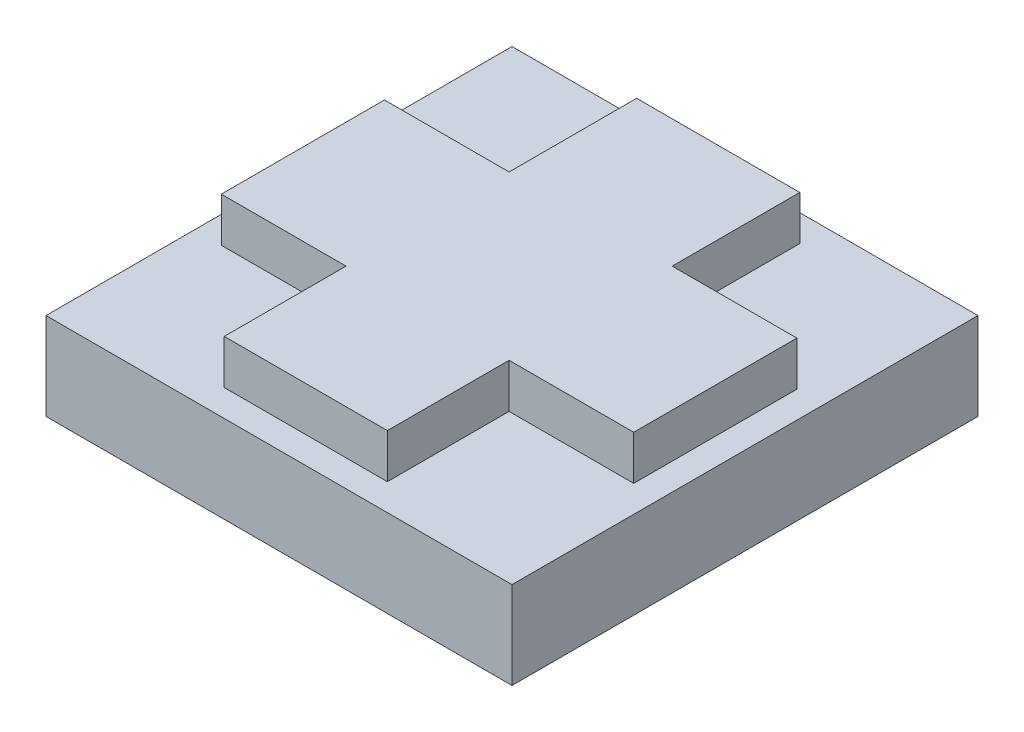
ISO-10303-21;
HEADER;
FILE_DESCRIPTION(('STEP AP214'),'2;1');
FILE_NAME('part.step','',(''),(''),'','','');
FILE_SCHEMA(('AUTOMOTIVE_DESIGN { 1 0 10303 214 1 1 1 1 }'));
ENDSEC;
DATA;
#1=APPLICATION_CONTEXT('core data for automotive mechanical design processes');
#2=APPLICATION_PROTOCOL_DEFINITION('international standard','automotive_design',2000,#1);
#3=PRODUCT_CONTEXT('',#1,'mechanical');
#4=PRODUCT('Part','Part','',(#3));
#5=PRODUCT_RELATED_PRODUCT_CATEGORY('part','',(#4));
#6=PRODUCT_DEFINITION_FORMATION('','',#4);
#7=PRODUCT_DEFINITION_CONTEXT('part definition',#1,'design');
#8=PRODUCT_DEFINITION('design','',#6,#7);
#9=PRODUCT_DEFINITION_SHAPE('','',#8);
#10=(LENGTH_UNIT() NAMED_UNIT(*) SI_UNIT(.MILLI.,.METRE.));
#11=(NAMED_UNIT(*) PLANE_ANGLE_UNIT() SI_UNIT($,.RADIAN.));
#12=(NAMED_UNIT(*) SI_UNIT($,.STERADIAN.) SOLID_ANGLE_UNIT());
#13=UNCERTAINTY_MEASURE_WITH_UNIT(LENGTH_MEASURE(1.E-05),#10,'distance_accuracy_value','');
#14=(GEOMETRIC_REPRESENTATION_CONTEXT(3) GLOBAL_UNCERTAINTY_ASSIGNED_CONTEXT((#13)) GLOBAL_UNIT_ASSIGNED_CONTEXT((#10,
#11,#12)) REPRESENTATION_CONTEXT('',''));
#15=CARTESIAN_POINT('',(0.,0.,0.));
#16=DIRECTION('',(0.,0.,1.));
#17=DIRECTION('',(1.,0.,0.));
#18=AXIS2_PLACEMENT_3D('',#15,#16,#17);
#19=CARTESIAN_POINT('',(0.,1.905,0.));
#20=DIRECTION('',(0.,-1.,0.));
#21=DIRECTION('',(0.,0.,-1.));
#22=AXIS2_PLACEMENT_3D('',#19,#20,#21);
#23=PLANE('',#22);
#24=DIRECTION('',(0.,0.,1.));
#25=VECTOR('',#24,1.);
#26=CARTESIAN_POINT('',(0.,1.905,0.));
#27=LINE('',#26,#25);
#28=CARTESIAN_POINT('',(0.,1.905,-10.16));
#29=VERTEX_POINT('',#28);
#30=CARTESIAN_POINT('',(0.,1.905,0.));
#31=VERTEX_POINT('',#30);
#32=EDGE_CURVE('E226',#29,#31,#27,.T.);
#33=ORIENTED_EDGE('',*,*,#32,.T.);
#34=DIRECTION('',(1.,0.,0.));
#35=VECTOR('',#34,1.);
#36=CARTESIAN_POINT('',(0.,1.905,0.));
#37=LINE('',#36,#35);
#38=CARTESIAN_POINT('',(10.16,1.905,0.));
#39=VERTEX_POINT('',#38);
#40=EDGE_CURVE('E229',#31,#39,#37,.T.);
#41=ORIENTED_EDGE('',*,*,#40,.T.);
#42=DIRECTION('',(0.,0.,-1.));
#43=VECTOR('',#42,1.);
#44=CARTESIAN_POINT('',(10.16,1.905,0.));
#45=LINE('',#44,#43);
#46=CARTESIAN_POINT('',(10.16,1.905,-10.16));
#47=VERTEX_POINT('',#46);
#48=EDGE_CURVE('E232',#39,#47,#45,.T.);
#49=ORIENTED_EDGE('',*,*,#48,.T.);
#50=DIRECTION('',(-1.,0.,0.));
#51=VECTOR('',#50,1.);
#52=CARTESIAN_POINT('',(0.,1.905,-10.16));
#53=LINE('',#52,#51);
#54=EDGE_CURVE('E234',#47,#29,#53,.T.);
#55=ORIENTED_EDGE('',*,*,#54,.T.);
#56=EDGE_LOOP('',(#33,#41,#49,#55));
#57=FACE_BOUND('',#56,.T.);
#58=DIRECTION('',(1.,0.,0.));
#59=VECTOR('',#58,1.);
#60=CARTESIAN_POINT('',(0.,1.905,-3.2385));
#61=LINE('',#60,#59);
#62=CARTESIAN_POINT('',(6.858,1.905,-3.2385));
#63=VERTEX_POINT('',#62);
#64=CARTESIAN_POINT('',(9.5758,1.905,-3.2385));
#65=VERTEX_POINT('',#64);
#66=EDGE_CURVE('E181',#63,#65,#61,.T.);
#67=ORIENTED_EDGE('',*,*,#66,.F.);
#68=DIRECTION('',(0.,0.,-1.));
#69=VECTOR('',#68,1.);
#70=CARTESIAN_POINT('',(6.858,1.905,0.));
#71=LINE('',#70,#69);
#72=CARTESIAN_POINT('',(6.858,1.905,-0.5842));
#73=VERTEX_POINT('',#72);
#74=EDGE_CURVE('E215',#73,#63,#71,.T.);
#75=ORIENTED_EDGE('',*,*,#74,.F.);
#76=DIRECTION('',(1.,0.,0.));
#77=VECTOR('',#76,1.);
#78=CARTESIAN_POINT('',(0.,1.905,-0.5842));
#79=LINE('',#78,#77);
#80=CARTESIAN_POINT('',(3.302,1.905,-0.5842));
#81=VERTEX_POINT('',#80);
#82=EDGE_CURVE('E218',#81,#73,#79,.T.);
#83=ORIENTED_EDGE('',*,*,#82,.F.);
#84=DIRECTION('',(0.,0.,1.));
#85=VECTOR('',#84,1.);
#86=CARTESIAN_POINT('',(3.302,1.905,0.));
#87=LINE('',#86,#85);
#88=CARTESIAN_POINT('',(3.302,1.905,-3.2385));
#89=VERTEX_POINT('',#88);
#90=EDGE_CURVE('E221',#89,#81,#87,.T.);
#91=ORIENTED_EDGE('',*,*,#90,.F.);
#92=CARTESIAN_POINT('',(0.584200000000001,1.905,-3.2385));
#93=VERTEX_POINT('',#92);
#94=EDGE_CURVE('E183',#93,#89,#61,.T.);
#95=ORIENTED_EDGE('',*,*,#94,.F.);
#96=DIRECTION('',(0.,0.,1.));
#97=VECTOR('',#96,1.);
#98=CARTESIAN_POINT('',(0.584200000000001,1.905,0.));
#99=LINE('',#98,#97);
#100=CARTESIAN_POINT('',(0.5842,1.905,-6.7945));
#101=VERTEX_POINT('',#100);
#102=EDGE_CURVE('E164',#101,#93,#99,.T.);
#103=ORIENTED_EDGE('',*,*,#102,.F.);
#104=DIRECTION('',(-1.,0.,0.));
#105=VECTOR('',#104,1.);
#106=CARTESIAN_POINT('',(0.,1.905,-6.7945));
#107=LINE('',#106,#105);
#108=CARTESIAN_POINT('',(3.302,1.905,-6.7945));
#109=VERTEX_POINT('',#108);
#110=EDGE_CURVE('E177',#109,#101,#107,.T.);
#111=ORIENTED_EDGE('',*,*,#110,.F.);
#112=CARTESIAN_POINT('',(3.302,1.905,-9.5758));
#113=VERTEX_POINT('',#112);
#114=EDGE_CURVE('E222',#113,#109,#87,.T.);
#115=ORIENTED_EDGE('',*,*,#114,.F.);
#116=DIRECTION('',(-1.,0.,0.));
#117=VECTOR('',#116,1.);
#118=CARTESIAN_POINT('',(0.,1.905,-9.5758));
#119=LINE('',#118,#117);
#120=CARTESIAN_POINT('',(6.858,1.905,-9.5758));
#121=VERTEX_POINT('',#120);
#122=EDGE_CURVE('E211',#121,#113,#119,.T.);
#123=ORIENTED_EDGE('',*,*,#122,.F.);
#124=CARTESIAN_POINT('',(6.858,1.905,-6.7945));
#125=VERTEX_POINT('',#124);
#126=EDGE_CURVE('E214',#125,#121,#71,.T.);
#127=ORIENTED_EDGE('',*,*,#126,.F.);
#128=CARTESIAN_POINT('',(9.5758,1.905,-6.7945));
#129=VERTEX_POINT('',#128);
#130=EDGE_CURVE('E168',#129,#125,#107,.T.);
#131=ORIENTED_EDGE('',*,*,#130,.F.);
#132=DIRECTION('',(0.,0.,-1.));
#133=VECTOR('',#132,1.);
#134=CARTESIAN_POINT('',(9.5758,1.905,0.));
#135=LINE('',#134,#133);
#136=EDGE_CURVE('E185',#65,#129,#135,.T.);
#137=ORIENTED_EDGE('',*,*,#136,.F.);
#138=EDGE_LOOP('',(#67,#75,#83,#91,#95,#103,#111,#115,#123,#127,#131,#137));
#139=FACE_BOUND('',#138,.T.);
#140=ADVANCED_FACE('F32',(#57,#139),#23,.F.);
#141=CARTESIAN_POINT('',(3.302,2.8702,-0.5842));
#142=DIRECTION('',(1.,0.,0.));
#143=DIRECTION('',(0.,0.,-1.));
#144=AXIS2_PLACEMENT_3D('',#141,#142,#143);
#145=PLANE('',#144);
#146=DIRECTION('',(0.,1.,0.));
#147=VECTOR('',#146,1.);
#148=CARTESIAN_POINT('',(3.302,2.8702,-3.2385));
#149=LINE('',#148,#147);
#150=CARTESIAN_POINT('',(3.302,2.8702,-3.2385));
#151=VERTEX_POINT('',#150);
#152=EDGE_CURVE('E148',#89,#151,#149,.T.);
#153=ORIENTED_EDGE('',*,*,#152,.F.);
#154=ORIENTED_EDGE('',*,*,#90,.T.);
#155=DIRECTION('',(0.,-1.,0.));
#156=VECTOR('',#155,1.);
#157=CARTESIAN_POINT('',(3.302,2.8702,-0.5842));
#158=LINE('',#157,#156);
#159=CARTESIAN_POINT('',(3.302,2.8702,-0.5842));
#160=VERTEX_POINT('',#159);
#161=EDGE_CURVE('E208',#160,#81,#158,.T.);
#162=ORIENTED_EDGE('',*,*,#161,.F.);
#163=DIRECTION('',(0.,0.,1.));
#164=VECTOR('',#163,1.);
#165=CARTESIAN_POINT('',(3.302,2.8702,-0.5842));
#166=LINE('',#165,#164);
#167=EDGE_CURVE('E188',#151,#160,#166,.T.);
#168=ORIENTED_EDGE('',*,*,#167,.F.);
#169=EDGE_LOOP('',(#153,#154,#162,#168));
#170=FACE_BOUND('',#169,.T.);
#171=ADVANCED_FACE('F278',(#170),#145,.F.);
#172=DIRECTION('',(0.,-1.,0.));
#173=VECTOR('',#172,1.);
#174=CARTESIAN_POINT('',(3.302,2.8702,-6.7945));
#175=LINE('',#174,#173);
#176=CARTESIAN_POINT('',(3.302,2.8702,-6.7945));
#177=VERTEX_POINT('',#176);
#178=EDGE_CURVE('E176',#177,#109,#175,.T.);
#179=ORIENTED_EDGE('',*,*,#178,.F.);
#180=CARTESIAN_POINT('',(3.302,2.8702,-9.5758));
#181=VERTEX_POINT('',#180);
#182=EDGE_CURVE('E189',#181,#177,#166,.T.);
#183=ORIENTED_EDGE('',*,*,#182,.F.);
#184=DIRECTION('',(0.,-1.,0.));
#185=VECTOR('',#184,1.);
#186=CARTESIAN_POINT('',(3.302,2.8702,-9.5758));
#187=LINE('',#186,#185);
#188=EDGE_CURVE('E199',#181,#113,#187,.T.);
#189=ORIENTED_EDGE('',*,*,#188,.T.);
#190=ORIENTED_EDGE('',*,*,#114,.T.);
#191=EDGE_LOOP('',(#179,#183,#189,#190));
#192=FACE_BOUND('',#191,.T.);
#193=ADVANCED_FACE('F283',(#192),#145,.F.);
#194=CARTESIAN_POINT('',(6.858,2.8702,-0.5842));
#195=DIRECTION('',(-1.,0.,0.));
#196=DIRECTION('',(0.,0.,1.));
#197=AXIS2_PLACEMENT_3D('',#194,#195,#196);
#198=PLANE('',#197);
#199=DIRECTION('',(0.,-1.,0.));
#200=VECTOR('',#199,1.);
#201=CARTESIAN_POINT('',(6.858,2.8702,-3.2385));
#202=LINE('',#201,#200);
#203=CARTESIAN_POINT('',(6.858,2.8702,-3.2385));
#204=VERTEX_POINT('',#203);
#205=EDGE_CURVE('E179',#204,#63,#202,.T.);
#206=ORIENTED_EDGE('',*,*,#205,.F.);
#207=DIRECTION('',(0.,0.,-1.));
#208=VECTOR('',#207,1.);
#209=CARTESIAN_POINT('',(6.858,2.8702,-0.5842));
#210=LINE('',#209,#208);
#211=CARTESIAN_POINT('',(6.858,2.8702,-0.5842));
#212=VERTEX_POINT('',#211);
#213=EDGE_CURVE('E194',#212,#204,#210,.T.);
#214=ORIENTED_EDGE('',*,*,#213,.F.);
#215=DIRECTION('',(0.,-1.,0.));
#216=VECTOR('',#215,1.);
#217=CARTESIAN_POINT('',(6.858,2.8702,-0.5842));
#218=LINE('',#217,#216);
#219=EDGE_CURVE('E205',#212,#73,#218,.T.);
#220=ORIENTED_EDGE('',*,*,#219,.T.);
#221=ORIENTED_EDGE('',*,*,#74,.T.);
#222=EDGE_LOOP('',(#206,#214,#220,#221));
#223=FACE_BOUND('',#222,.T.);
#224=ADVANCED_FACE('F398',(#223),#198,.F.);
#225=DIRECTION('',(0.,1.,0.));
#226=VECTOR('',#225,1.);
#227=CARTESIAN_POINT('',(6.858,2.8702,-6.7945));
#228=LINE('',#227,#226);
#229=CARTESIAN_POINT('',(6.858,2.8702,-6.7945));
#230=VERTEX_POINT('',#229);
#231=EDGE_CURVE('E165',#125,#230,#228,.T.);
#232=ORIENTED_EDGE('',*,*,#231,.F.);
#233=ORIENTED_EDGE('',*,*,#126,.T.);
#234=DIRECTION('',(0.,-1.,0.));
#235=VECTOR('',#234,1.);
#236=CARTESIAN_POINT('',(6.858,2.8702,-9.5758));
#237=LINE('',#236,#235);
#238=CARTESIAN_POINT('',(6.858,2.8702,-9.5758));
#239=VERTEX_POINT('',#238);
#240=EDGE_CURVE('E202',#239,#121,#237,.T.);
#241=ORIENTED_EDGE('',*,*,#240,.F.);
#242=EDGE_CURVE('E193',#230,#239,#210,.T.);
#243=ORIENTED_EDGE('',*,*,#242,.F.);
#244=EDGE_LOOP('',(#232,#233,#241,#243));
#245=FACE_BOUND('',#244,.T.);
#246=ADVANCED_FACE('F276',(#245),#198,.F.);
#247=CARTESIAN_POINT('',(0.,1.905,0.));
#248=DIRECTION('',(1.,0.,0.));
#249=DIRECTION('',(0.,0.,-1.));
#250=AXIS2_PLACEMENT_3D('',#247,#248,#249);
#251=PLANE('',#250);
#252=DIRECTION('',(0.,0.,1.));
#253=VECTOR('',#252,1.);
#254=CARTESIAN_POINT('',(0.,0.,0.));
#255=LINE('',#254,#253);
#256=CARTESIAN_POINT('',(0.,0.,-10.16));
#257=VERTEX_POINT('',#256);
#258=CARTESIAN_POINT('',(0.,0.,0.));
#259=VERTEX_POINT('',#258);
#260=EDGE_CURVE('E225',#257,#259,#255,.T.);
#261=ORIENTED_EDGE('',*,*,#260,.T.);
#262=DIRECTION('',(0.,-1.,0.));
#263=VECTOR('',#262,1.);
#264=CARTESIAN_POINT('',(0.,1.905,0.));
#265=LINE('',#264,#263);
#266=EDGE_CURVE('E11',#31,#259,#265,.T.);
#267=ORIENTED_EDGE('',*,*,#266,.F.);
#268=ORIENTED_EDGE('',*,*,#32,.F.);
#269=DIRECTION('',(0.,-1.,0.));
#270=VECTOR('',#269,1.);
#271=CARTESIAN_POINT('',(0.,1.905,-10.16));
#272=LINE('',#271,#270);
#273=EDGE_CURVE('E236',#29,#257,#272,.T.);
#274=ORIENTED_EDGE('',*,*,#273,.T.);
#275=EDGE_LOOP('',(#261,#267,#268,#274));
#276=FACE_BOUND('',#275,.T.);
#277=ADVANCED_FACE('F34',(#276),#251,.F.);
#278=CARTESIAN_POINT('',(0.,1.905,0.));
#279=DIRECTION('',(0.,0.,-1.));
#280=DIRECTION('',(-1.,0.,0.));
#281=AXIS2_PLACEMENT_3D('',#278,#279,#280);
#282=PLANE('',#281);
#283=DIRECTION('',(1.,0.,0.));
#284=VECTOR('',#283,1.);
#285=CARTESIAN_POINT('',(0.,0.,0.));
#286=LINE('',#285,#284);
#287=CARTESIAN_POINT('',(10.16,0.,0.));
#288=VERTEX_POINT('',#287);
#289=EDGE_CURVE('E239',#259,#288,#286,.T.);
#290=ORIENTED_EDGE('',*,*,#289,.T.);
#291=DIRECTION('',(0.,-1.,0.));
#292=VECTOR('',#291,1.);
#293=CARTESIAN_POINT('',(10.16,1.905,0.));
#294=LINE('',#293,#292);
#295=EDGE_CURVE('E40',#39,#288,#294,.T.);
#296=ORIENTED_EDGE('',*,*,#295,.F.);
#297=ORIENTED_EDGE('',*,*,#40,.F.);
#298=ORIENTED_EDGE('',*,*,#266,.T.);
#299=EDGE_LOOP('',(#290,#296,#297,#298));
#300=FACE_BOUND('',#299,.T.);
#301=ADVANCED_FACE('F269',(#300),#282,.F.);
#302=CARTESIAN_POINT('',(10.16,1.905,0.));
#303=DIRECTION('',(-1.,0.,0.));
#304=DIRECTION('',(0.,0.,1.));
#305=AXIS2_PLACEMENT_3D('',#302,#303,#304);
#306=PLANE('',#305);
#307=DIRECTION('',(0.,0.,-1.));
#308=VECTOR('',#307,1.);
#309=CARTESIAN_POINT('',(10.16,0.,0.));
#310=LINE('',#309,#308);
#311=CARTESIAN_POINT('',(10.16,0.,-10.16));
#312=VERTEX_POINT('',#311);
#313=EDGE_CURVE('E241',#288,#312,#310,.T.);
#314=ORIENTED_EDGE('',*,*,#313,.T.);
#315=DIRECTION('',(0.,-1.,0.));
#316=VECTOR('',#315,1.);
#317=CARTESIAN_POINT('',(10.16,1.905,-10.16));
#318=LINE('',#317,#316);
#319=EDGE_CURVE('E246',#47,#312,#318,.T.);
#320=ORIENTED_EDGE('',*,*,#319,.F.);
#321=ORIENTED_EDGE('',*,*,#48,.F.);
#322=ORIENTED_EDGE('',*,*,#295,.T.);
#323=EDGE_LOOP('',(#314,#320,#321,#322));
#324=FACE_BOUND('',#323,.T.);
#325=ADVANCED_FACE('F253',(#324),#306,.F.);
#326=CARTESIAN_POINT('',(0.,1.905,-10.16));
#327=DIRECTION('',(0.,0.,1.));
#328=DIRECTION('',(1.,0.,0.));
#329=AXIS2_PLACEMENT_3D('',#326,#327,#328);
#330=PLANE('',#329);
#331=DIRECTION('',(-1.,0.,0.));
#332=VECTOR('',#331,1.);
#333=CARTESIAN_POINT('',(0.,0.,-10.16));
#334=LINE('',#333,#332);
#335=EDGE_CURVE('E230',#312,#257,#334,.T.);
#336=ORIENTED_EDGE('',*,*,#335,.T.);
#337=ORIENTED_EDGE('',*,*,#273,.F.);
#338=ORIENTED_EDGE('',*,*,#54,.F.);
#339=ORIENTED_EDGE('',*,*,#319,.T.);
#340=EDGE_LOOP('',(#336,#337,#338,#339));
#341=FACE_BOUND('',#340,.T.);
#342=ADVANCED_FACE('F262',(#341),#330,.F.);
#343=CARTESIAN_POINT('',(0.,0.,0.));
#344=DIRECTION('',(0.,-1.,0.));
#345=DIRECTION('',(0.,0.,-1.));
#346=AXIS2_PLACEMENT_3D('',#343,#344,#345);
#347=PLANE('',#346);
#348=ORIENTED_EDGE('',*,*,#260,.F.);
#349=ORIENTED_EDGE('',*,*,#335,.F.);
#350=ORIENTED_EDGE('',*,*,#313,.F.);
#351=ORIENTED_EDGE('',*,*,#289,.F.);
#352=EDGE_LOOP('',(#348,#349,#350,#351));
#353=FACE_BOUND('',#352,.T.);
#354=ADVANCED_FACE('F259',(#353),#347,.T.);
#355=CARTESIAN_POINT('',(3.302,2.8702,-0.5842));
#356=DIRECTION('',(0.,0.,-1.));
#357=DIRECTION('',(-1.,0.,0.));
#358=AXIS2_PLACEMENT_3D('',#355,#356,#357);
#359=PLANE('',#358);
#360=ORIENTED_EDGE('',*,*,#161,.T.);
#361=ORIENTED_EDGE('',*,*,#82,.T.);
#362=ORIENTED_EDGE('',*,*,#219,.F.);
#363=DIRECTION('',(1.,0.,0.));
#364=VECTOR('',#363,1.);
#365=CARTESIAN_POINT('',(3.302,2.8702,-0.5842));
#366=LINE('',#365,#364);
#367=EDGE_CURVE('E191',#160,#212,#366,.T.);
#368=ORIENTED_EDGE('',*,*,#367,.F.);
#369=EDGE_LOOP('',(#360,#361,#362,#368));
#370=FACE_BOUND('',#369,.T.);
#371=ADVANCED_FACE('F290',(#370),#359,.F.);
#372=CARTESIAN_POINT('',(3.302,2.8702,-9.5758));
#373=DIRECTION('',(0.,0.,1.));
#374=DIRECTION('',(1.,0.,0.));
#375=AXIS2_PLACEMENT_3D('',#372,#373,#374);
#376=PLANE('',#375);
#377=ORIENTED_EDGE('',*,*,#240,.T.);
#378=ORIENTED_EDGE('',*,*,#122,.T.);
#379=ORIENTED_EDGE('',*,*,#188,.F.);
#380=DIRECTION('',(-1.,0.,0.));
#381=VECTOR('',#380,1.);
#382=CARTESIAN_POINT('',(3.302,2.8702,-9.5758));
#383=LINE('',#382,#381);
#384=EDGE_CURVE('E197',#239,#181,#383,.T.);
#385=ORIENTED_EDGE('',*,*,#384,.F.);
#386=EDGE_LOOP('',(#377,#378,#379,#385));
#387=FACE_BOUND('',#386,.T.);
#388=ADVANCED_FACE('F308',(#387),#376,.F.);
#389=CARTESIAN_POINT('',(0.,2.8702,0.));
#390=DIRECTION('',(0.,-1.,0.));
#391=DIRECTION('',(0.,0.,-1.));
#392=AXIS2_PLACEMENT_3D('',#389,#390,#391);
#393=PLANE('',#392);
#394=ORIENTED_EDGE('',*,*,#182,.T.);
#395=DIRECTION('',(-1.,0.,0.));
#396=VECTOR('',#395,1.);
#397=CARTESIAN_POINT('',(0.5842,2.8702,-6.7945));
#398=LINE('',#397,#396);
#399=CARTESIAN_POINT('',(0.5842,2.8702,-6.7945));
#400=VERTEX_POINT('',#399);
#401=EDGE_CURVE('E157',#177,#400,#398,.T.);
#402=ORIENTED_EDGE('',*,*,#401,.T.);
#403=DIRECTION('',(0.,0.,1.));
#404=VECTOR('',#403,1.);
#405=CARTESIAN_POINT('',(0.5842,2.8702,-6.7945));
#406=LINE('',#405,#404);
#407=CARTESIAN_POINT('',(0.584200000000001,2.8702,-3.2385));
#408=VERTEX_POINT('',#407);
#409=EDGE_CURVE('E154',#400,#408,#406,.T.);
#410=ORIENTED_EDGE('',*,*,#409,.T.);
#411=DIRECTION('',(1.,0.,0.));
#412=VECTOR('',#411,1.);
#413=CARTESIAN_POINT('',(0.584200000000001,2.8702,-3.2385));
#414=LINE('',#413,#412);
#415=EDGE_CURVE('E54',#408,#151,#414,.T.);
#416=ORIENTED_EDGE('',*,*,#415,.T.);
#417=ORIENTED_EDGE('',*,*,#167,.T.);
#418=ORIENTED_EDGE('',*,*,#367,.T.);
#419=ORIENTED_EDGE('',*,*,#213,.T.);
#420=CARTESIAN_POINT('',(9.5758,2.8702,-3.2385));
#421=VERTEX_POINT('',#420);
#422=EDGE_CURVE('E151',#204,#421,#414,.T.);
#423=ORIENTED_EDGE('',*,*,#422,.T.);
#424=DIRECTION('',(0.,0.,-1.));
#425=VECTOR('',#424,1.);
#426=CARTESIAN_POINT('',(9.5758,2.8702,-6.7945));
#427=LINE('',#426,#425);
#428=CARTESIAN_POINT('',(9.5758,2.8702,-6.7945));
#429=VERTEX_POINT('',#428);
#430=EDGE_CURVE('E150',#421,#429,#427,.T.);
#431=ORIENTED_EDGE('',*,*,#430,.T.);
#432=EDGE_CURVE('E47',#429,#230,#398,.T.);
#433=ORIENTED_EDGE('',*,*,#432,.T.);
#434=ORIENTED_EDGE('',*,*,#242,.T.);
#435=ORIENTED_EDGE('',*,*,#384,.T.);
#436=EDGE_LOOP('',(#394,#402,#410,#416,#417,#418,#419,#423,#431,#433,#434,#435));
#437=FACE_BOUND('',#436,.T.);
#438=ADVANCED_FACE('F156',(#437),#393,.F.);
#439=CARTESIAN_POINT('',(0.5842,2.8702,-6.7945));
#440=DIRECTION('',(0.,0.,1.));
#441=DIRECTION('',(1.,0.,0.));
#442=AXIS2_PLACEMENT_3D('',#439,#440,#441);
#443=PLANE('',#442);
#444=DIRECTION('',(0.,-1.,0.));
#445=VECTOR('',#444,1.);
#446=CARTESIAN_POINT('',(9.5758,2.8702,-6.7945));
#447=LINE('',#446,#445);
#448=EDGE_CURVE('E171',#429,#129,#447,.T.);
#449=ORIENTED_EDGE('',*,*,#448,.T.);
#450=ORIENTED_EDGE('',*,*,#130,.T.);
#451=ORIENTED_EDGE('',*,*,#231,.T.);
#452=ORIENTED_EDGE('',*,*,#432,.F.);
#453=EDGE_LOOP('',(#449,#450,#451,#452));
#454=FACE_BOUND('',#453,.T.);
#455=ADVANCED_FACE('F321',(#454),#443,.F.);
#456=CARTESIAN_POINT('',(0.584200000000001,2.8702,-3.2385));
#457=DIRECTION('',(0.,0.,-1.));
#458=DIRECTION('',(-1.,0.,0.));
#459=AXIS2_PLACEMENT_3D('',#456,#457,#458);
#460=PLANE('',#459);
#461=ORIENTED_EDGE('',*,*,#205,.T.);
#462=ORIENTED_EDGE('',*,*,#66,.T.);
#463=DIRECTION('',(0.,-1.,0.));
#464=VECTOR('',#463,1.);
#465=CARTESIAN_POINT('',(9.5758,2.8702,-3.2385));
#466=LINE('',#465,#464);
#467=EDGE_CURVE('E166',#421,#65,#466,.T.);
#468=ORIENTED_EDGE('',*,*,#467,.F.);
#469=ORIENTED_EDGE('',*,*,#422,.F.);
#470=EDGE_LOOP('',(#461,#462,#468,#469));
#471=FACE_BOUND('',#470,.T.);
#472=ADVANCED_FACE('F328',(#471),#460,.F.);
#473=CARTESIAN_POINT('',(9.5758,2.8702,-6.7945));
#474=DIRECTION('',(-1.,0.,0.));
#475=DIRECTION('',(0.,0.,1.));
#476=AXIS2_PLACEMENT_3D('',#473,#474,#475);
#477=PLANE('',#476);
#478=ORIENTED_EDGE('',*,*,#467,.T.);
#479=ORIENTED_EDGE('',*,*,#136,.T.);
#480=ORIENTED_EDGE('',*,*,#448,.F.);
#481=ORIENTED_EDGE('',*,*,#430,.F.);
#482=EDGE_LOOP('',(#478,#479,#480,#481));
#483=FACE_BOUND('',#482,.T.);
#484=ADVANCED_FACE('F337',(#483),#477,.F.);
#485=CARTESIAN_POINT('',(0.5842,2.8702,-6.7945));
#486=DIRECTION('',(1.,0.,0.));
#487=DIRECTION('',(0.,0.,-1.));
#488=AXIS2_PLACEMENT_3D('',#485,#486,#487);
#489=PLANE('',#488);
#490=DIRECTION('',(0.,-1.,0.));
#491=VECTOR('',#490,1.);
#492=CARTESIAN_POINT('',(0.5842,2.8702,-6.7945));
#493=LINE('',#492,#491);
#494=EDGE_CURVE('E466',#400,#101,#493,.T.);
#495=ORIENTED_EDGE('',*,*,#494,.T.);
#496=ORIENTED_EDGE('',*,*,#102,.T.);
#497=DIRECTION('',(0.,-1.,0.));
#498=VECTOR('',#497,1.);
#499=CARTESIAN_POINT('',(0.584200000000001,2.8702,-3.2385));
#500=LINE('',#499,#498);
#501=EDGE_CURVE('E145',#408,#93,#500,.T.);
#502=ORIENTED_EDGE('',*,*,#501,.F.);
#503=ORIENTED_EDGE('',*,*,#409,.F.);
#504=EDGE_LOOP('',(#495,#496,#502,#503));
#505=FACE_BOUND('',#504,.T.);
#506=ADVANCED_FACE('F162',(#505),#489,.F.);
#507=ORIENTED_EDGE('',*,*,#501,.T.);
#508=ORIENTED_EDGE('',*,*,#94,.T.);
#509=ORIENTED_EDGE('',*,*,#152,.T.);
#510=ORIENTED_EDGE('',*,*,#415,.F.);
#511=EDGE_LOOP('',(#507,#508,#509,#510));
#512=FACE_BOUND('',#511,.T.);
#513=ADVANCED_FACE('F143',(#512),#460,.F.);
#514=ORIENTED_EDGE('',*,*,#178,.T.);
#515=ORIENTED_EDGE('',*,*,#110,.T.);
#516=ORIENTED_EDGE('',*,*,#494,.F.);
#517=ORIENTED_EDGE('',*,*,#401,.F.);
#518=EDGE_LOOP('',(#514,#515,#516,#517));
#519=FACE_BOUND('',#518,.T.);
#520=ADVANCED_FACE('F331',(#519),#443,.F.);
#521=CLOSED_SHELL('',(#140,#171,#193,#224,#246,#277,#301,#325,#342,#354,#371,#388,#438,#455,
#472,#484,#506,#513,#520));
#522=MANIFOLD_SOLID_BREP('B2',#521);
#523=ADVANCED_BREP_SHAPE_REPRESENTATION('',(#18,#522),#14);
#524=SHAPE_DEFINITION_REPRESENTATION(#9,#523);
ENDSEC;
END-ISO-10303-21;
